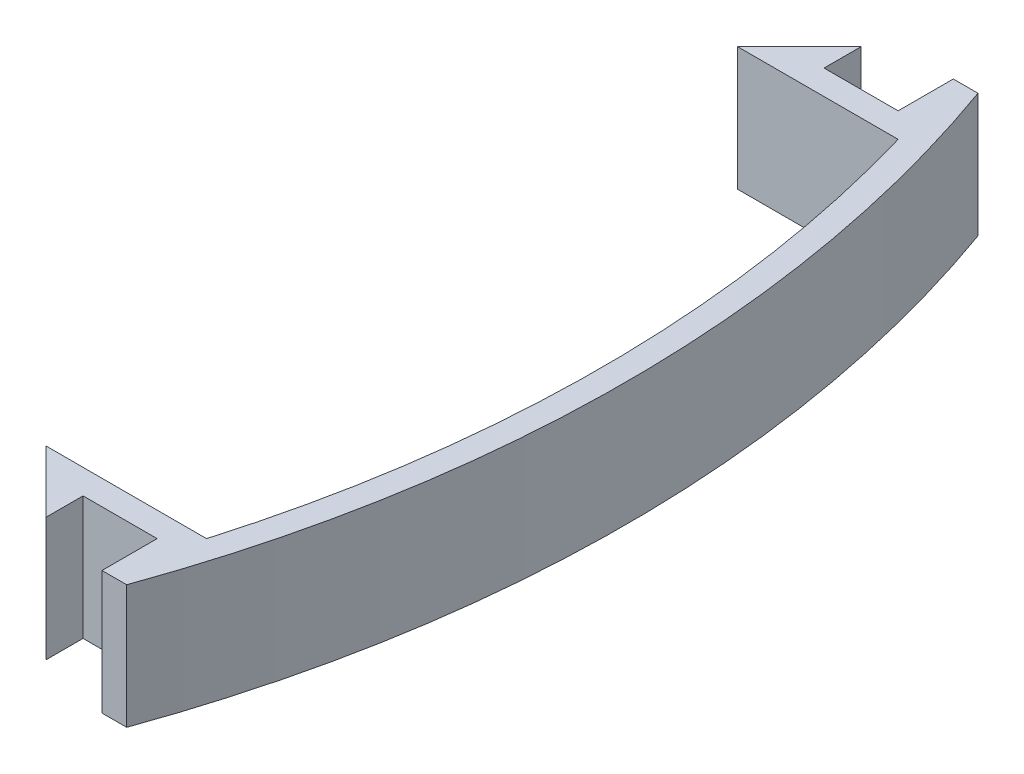
ISO-10303-21;
HEADER;
FILE_DESCRIPTION(('STEP AP214'),'2;1');
FILE_NAME('part.step','',(''),(''),'','','');
FILE_SCHEMA(('AUTOMOTIVE_DESIGN { 1 0 10303 214 1 1 1 1 }'));
ENDSEC;
DATA;
#1=APPLICATION_CONTEXT('core data for automotive mechanical design processes');
#2=APPLICATION_PROTOCOL_DEFINITION('international standard','automotive_design',2000,#1);
#3=PRODUCT_CONTEXT('',#1,'mechanical');
#4=PRODUCT('Part','Part','',(#3));
#5=PRODUCT_RELATED_PRODUCT_CATEGORY('part','',(#4));
#6=PRODUCT_DEFINITION_FORMATION('','',#4);
#7=PRODUCT_DEFINITION_CONTEXT('part definition',#1,'design');
#8=PRODUCT_DEFINITION('design','',#6,#7);
#9=PRODUCT_DEFINITION_SHAPE('','',#8);
#10=(LENGTH_UNIT() NAMED_UNIT(*) SI_UNIT(.MILLI.,.METRE.));
#11=(NAMED_UNIT(*) PLANE_ANGLE_UNIT() SI_UNIT($,.RADIAN.));
#12=(NAMED_UNIT(*) SI_UNIT($,.STERADIAN.) SOLID_ANGLE_UNIT());
#13=UNCERTAINTY_MEASURE_WITH_UNIT(LENGTH_MEASURE(1.E-05),#10,'distance_accuracy_value','');
#14=(GEOMETRIC_REPRESENTATION_CONTEXT(3) GLOBAL_UNCERTAINTY_ASSIGNED_CONTEXT((#13)) GLOBAL_UNIT_ASSIGNED_CONTEXT((#10,
#11,#12)) REPRESENTATION_CONTEXT('',''));
#15=CARTESIAN_POINT('',(0.,0.,0.));
#16=DIRECTION('',(0.,0.,1.));
#17=DIRECTION('',(1.,0.,0.));
#18=AXIS2_PLACEMENT_3D('',#15,#16,#17);
#19=CARTESIAN_POINT('',(-96.,10.,0.));
#20=DIRECTION('',(0.,-1.,0.));
#21=DIRECTION('',(0.,0.,-1.));
#22=AXIS2_PLACEMENT_3D('',#19,#20,#21);
#23=CYLINDRICAL_SURFACE('',#22,100.);
#24=CARTESIAN_POINT('',(-96.,0.,0.));
#25=DIRECTION('',(0.,-1.,0.));
#26=DIRECTION('',(0.,0.,-1.));
#27=AXIS2_PLACEMENT_3D('',#24,#25,#26);
#28=CIRCLE('',#27,100.);
#29=CARTESIAN_POINT('',(0.,0.,-28.));
#30=VERTEX_POINT('',#29);
#31=CARTESIAN_POINT('',(0.,0.,28.));
#32=VERTEX_POINT('',#31);
#33=EDGE_CURVE('E167',#30,#32,#28,.T.);
#34=ORIENTED_EDGE('',*,*,#33,.T.);
#35=DIRECTION('',(0.,-1.,0.));
#36=VECTOR('',#35,1.);
#37=CARTESIAN_POINT('',(0.,10.,28.));
#38=LINE('',#37,#36);
#39=CARTESIAN_POINT('',(0.,10.,28.));
#40=VERTEX_POINT('',#39);
#41=EDGE_CURVE('E11',#40,#32,#38,.T.);
#42=ORIENTED_EDGE('',*,*,#41,.F.);
#43=CARTESIAN_POINT('',(-96.,10.,0.));
#44=DIRECTION('',(0.,-1.,0.));
#45=DIRECTION('',(0.,0.,-1.));
#46=AXIS2_PLACEMENT_3D('',#43,#44,#45);
#47=CIRCLE('',#46,100.);
#48=CARTESIAN_POINT('',(0.,10.,-28.));
#49=VERTEX_POINT('',#48);
#50=EDGE_CURVE('E193',#49,#40,#47,.T.);
#51=ORIENTED_EDGE('',*,*,#50,.F.);
#52=DIRECTION('',(0.,-1.,0.));
#53=VECTOR('',#52,1.);
#54=CARTESIAN_POINT('',(0.,10.,-28.));
#55=LINE('',#54,#53);
#56=EDGE_CURVE('E163',#49,#30,#55,.T.);
#57=ORIENTED_EDGE('',*,*,#56,.T.);
#58=EDGE_LOOP('',(#34,#42,#51,#57));
#59=FACE_BOUND('',#58,.T.);
#60=ADVANCED_FACE('F35',(#59),#23,.F.);
#61=CARTESIAN_POINT('',(0.,10.,28.));
#62=DIRECTION('',(0.,0.,1.));
#63=DIRECTION('',(1.,0.,0.));
#64=AXIS2_PLACEMENT_3D('',#61,#62,#63);
#65=PLANE('',#64);
#66=DIRECTION('',(-1.,0.,0.));
#67=VECTOR('',#66,1.);
#68=CARTESIAN_POINT('',(0.,0.,28.));
#69=LINE('',#68,#67);
#70=CARTESIAN_POINT('',(-13.,0.,28.));
#71=VERTEX_POINT('',#70);
#72=EDGE_CURVE('E170',#32,#71,#69,.T.);
#73=ORIENTED_EDGE('',*,*,#72,.T.);
#74=DIRECTION('',(0.,-1.,0.));
#75=VECTOR('',#74,1.);
#76=CARTESIAN_POINT('',(-13.,10.,28.));
#77=LINE('',#76,#75);
#78=CARTESIAN_POINT('',(-13.,10.,28.));
#79=VERTEX_POINT('',#78);
#80=EDGE_CURVE('E43',#79,#71,#77,.T.);
#81=ORIENTED_EDGE('',*,*,#80,.F.);
#82=DIRECTION('',(-1.,0.,0.));
#83=VECTOR('',#82,1.);
#84=CARTESIAN_POINT('',(0.,10.,28.));
#85=LINE('',#84,#83);
#86=EDGE_CURVE('E112',#40,#79,#85,.T.);
#87=ORIENTED_EDGE('',*,*,#86,.F.);
#88=ORIENTED_EDGE('',*,*,#41,.T.);
#89=EDGE_LOOP('',(#73,#81,#87,#88));
#90=FACE_BOUND('',#89,.T.);
#91=ADVANCED_FACE('F281',(#90),#65,.F.);
#92=CARTESIAN_POINT('',(-13.,10.,28.));
#93=DIRECTION('',(0.707106781186548,0.,-0.707106781186547));
#94=DIRECTION('',(-0.707106781186547,0.,-0.707106781186548));
#95=AXIS2_PLACEMENT_3D('',#92,#93,#94);
#96=PLANE('',#95);
#97=DIRECTION('',(0.707106781186547,0.,0.707106781186548));
#98=VECTOR('',#97,1.);
#99=CARTESIAN_POINT('',(-13.,0.,28.));
#100=LINE('',#99,#98);
#101=CARTESIAN_POINT('',(-7.99999999999999,0.,33.));
#102=VERTEX_POINT('',#101);
#103=EDGE_CURVE('E172',#71,#102,#100,.T.);
#104=ORIENTED_EDGE('',*,*,#103,.T.);
#105=DIRECTION('',(0.,-1.,0.));
#106=VECTOR('',#105,1.);
#107=CARTESIAN_POINT('',(-7.99999999999999,10.,33.));
#108=LINE('',#107,#106);
#109=CARTESIAN_POINT('',(-7.99999999999999,10.,33.));
#110=VERTEX_POINT('',#109);
#111=EDGE_CURVE('E218',#110,#102,#108,.T.);
#112=ORIENTED_EDGE('',*,*,#111,.F.);
#113=DIRECTION('',(0.707106781186547,0.,0.707106781186548));
#114=VECTOR('',#113,1.);
#115=CARTESIAN_POINT('',(-13.,10.,28.));
#116=LINE('',#115,#114);
#117=EDGE_CURVE('E226',#79,#110,#116,.T.);
#118=ORIENTED_EDGE('',*,*,#117,.F.);
#119=ORIENTED_EDGE('',*,*,#80,.T.);
#120=EDGE_LOOP('',(#104,#112,#118,#119));
#121=FACE_BOUND('',#120,.T.);
#122=ADVANCED_FACE('F224',(#121),#96,.F.);
#123=CARTESIAN_POINT('',(-7.99999999999999,10.,33.));
#124=DIRECTION('',(-1.,0.,0.));
#125=DIRECTION('',(0.,0.,1.));
#126=AXIS2_PLACEMENT_3D('',#123,#124,#125);
#127=PLANE('',#126);
#128=DIRECTION('',(0.,0.,-1.));
#129=VECTOR('',#128,1.);
#130=CARTESIAN_POINT('',(-7.99999999999999,0.,33.));
#131=LINE('',#130,#129);
#132=CARTESIAN_POINT('',(-7.99999999999999,0.,30.));
#133=VERTEX_POINT('',#132);
#134=EDGE_CURVE('E174',#102,#133,#131,.T.);
#135=ORIENTED_EDGE('',*,*,#134,.T.);
#136=DIRECTION('',(0.,-1.,0.));
#137=VECTOR('',#136,1.);
#138=CARTESIAN_POINT('',(-7.99999999999999,10.,30.));
#139=LINE('',#138,#137);
#140=CARTESIAN_POINT('',(-7.99999999999999,10.,30.));
#141=VERTEX_POINT('',#140);
#142=EDGE_CURVE('E215',#141,#133,#139,.T.);
#143=ORIENTED_EDGE('',*,*,#142,.F.);
#144=DIRECTION('',(0.,0.,-1.));
#145=VECTOR('',#144,1.);
#146=CARTESIAN_POINT('',(-7.99999999999999,10.,33.));
#147=LINE('',#146,#145);
#148=EDGE_CURVE('E244',#110,#141,#147,.T.);
#149=ORIENTED_EDGE('',*,*,#148,.F.);
#150=ORIENTED_EDGE('',*,*,#111,.T.);
#151=EDGE_LOOP('',(#135,#143,#149,#150));
#152=FACE_BOUND('',#151,.T.);
#153=ADVANCED_FACE('F235',(#152),#127,.F.);
#154=CARTESIAN_POINT('',(-7.99999999999999,10.,30.));
#155=DIRECTION('',(0.,0.,-1.));
#156=DIRECTION('',(-1.,0.,0.));
#157=AXIS2_PLACEMENT_3D('',#154,#155,#156);
#158=PLANE('',#157);
#159=DIRECTION('',(1.,0.,0.));
#160=VECTOR('',#159,1.);
#161=CARTESIAN_POINT('',(-7.99999999999999,0.,30.));
#162=LINE('',#161,#160);
#163=CARTESIAN_POINT('',(-1.99999999999999,0.,30.));
#164=VERTEX_POINT('',#163);
#165=EDGE_CURVE('E176',#133,#164,#162,.T.);
#166=ORIENTED_EDGE('',*,*,#165,.T.);
#167=DIRECTION('',(0.,-1.,0.));
#168=VECTOR('',#167,1.);
#169=CARTESIAN_POINT('',(-1.99999999999999,10.,30.));
#170=LINE('',#169,#168);
#171=CARTESIAN_POINT('',(-1.99999999999999,10.,30.));
#172=VERTEX_POINT('',#171);
#173=EDGE_CURVE('E212',#172,#164,#170,.T.);
#174=ORIENTED_EDGE('',*,*,#173,.F.);
#175=DIRECTION('',(1.,0.,0.));
#176=VECTOR('',#175,1.);
#177=CARTESIAN_POINT('',(-7.99999999999999,10.,30.));
#178=LINE('',#177,#176);
#179=EDGE_CURVE('E241',#141,#172,#178,.T.);
#180=ORIENTED_EDGE('',*,*,#179,.F.);
#181=ORIENTED_EDGE('',*,*,#142,.T.);
#182=EDGE_LOOP('',(#166,#174,#180,#181));
#183=FACE_BOUND('',#182,.T.);
#184=ADVANCED_FACE('F239',(#183),#158,.F.);
#185=CARTESIAN_POINT('',(-1.99999999999999,10.,30.));
#186=DIRECTION('',(1.,0.,0.));
#187=DIRECTION('',(0.,0.,-1.));
#188=AXIS2_PLACEMENT_3D('',#185,#186,#187);
#189=PLANE('',#188);
#190=DIRECTION('',(0.,0.,1.));
#191=VECTOR('',#190,1.);
#192=CARTESIAN_POINT('',(-1.99999999999999,0.,30.));
#193=LINE('',#192,#191);
#194=CARTESIAN_POINT('',(-1.99999999999999,0.,34.4673758792282));
#195=VERTEX_POINT('',#194);
#196=EDGE_CURVE('E178',#164,#195,#193,.T.);
#197=ORIENTED_EDGE('',*,*,#196,.T.);
#198=DIRECTION('',(0.,-1.,0.));
#199=VECTOR('',#198,1.);
#200=CARTESIAN_POINT('',(-1.99999999999999,10.,34.4673758792282));
#201=LINE('',#200,#199);
#202=CARTESIAN_POINT('',(-1.99999999999999,10.,34.4673758792282));
#203=VERTEX_POINT('',#202);
#204=EDGE_CURVE('E209',#203,#195,#201,.T.);
#205=ORIENTED_EDGE('',*,*,#204,.F.);
#206=DIRECTION('',(0.,0.,1.));
#207=VECTOR('',#206,1.);
#208=CARTESIAN_POINT('',(-1.99999999999999,10.,30.));
#209=LINE('',#208,#207);
#210=EDGE_CURVE('E243',#172,#203,#209,.T.);
#211=ORIENTED_EDGE('',*,*,#210,.F.);
#212=ORIENTED_EDGE('',*,*,#173,.T.);
#213=EDGE_LOOP('',(#197,#205,#211,#212));
#214=FACE_BOUND('',#213,.T.);
#215=ADVANCED_FACE('F294',(#214),#189,.F.);
#216=CARTESIAN_POINT('',(0.,10.,34.4673758792282));
#217=DIRECTION('',(0.,0.,-1.));
#218=DIRECTION('',(-1.,0.,0.));
#219=AXIS2_PLACEMENT_3D('',#216,#217,#218);
#220=PLANE('',#219);
#221=DIRECTION('',(1.,0.,0.));
#222=VECTOR('',#221,1.);
#223=CARTESIAN_POINT('',(0.,0.,34.4673758792282));
#224=LINE('',#223,#222);
#225=CARTESIAN_POINT('',(0.,0.,34.4673758792282));
#226=VERTEX_POINT('',#225);
#227=EDGE_CURVE('E180',#195,#226,#224,.T.);
#228=ORIENTED_EDGE('',*,*,#227,.T.);
#229=DIRECTION('',(0.,-1.,0.));
#230=VECTOR('',#229,1.);
#231=CARTESIAN_POINT('',(0.,10.,34.4673758792282));
#232=LINE('',#231,#230);
#233=CARTESIAN_POINT('',(0.,10.,34.4673758792282));
#234=VERTEX_POINT('',#233);
#235=EDGE_CURVE('E206',#234,#226,#232,.T.);
#236=ORIENTED_EDGE('',*,*,#235,.F.);
#237=DIRECTION('',(1.,0.,0.));
#238=VECTOR('',#237,1.);
#239=CARTESIAN_POINT('',(0.,10.,34.4673758792282));
#240=LINE('',#239,#238);
#241=EDGE_CURVE('E246',#203,#234,#240,.T.);
#242=ORIENTED_EDGE('',*,*,#241,.F.);
#243=ORIENTED_EDGE('',*,*,#204,.T.);
#244=EDGE_LOOP('',(#228,#236,#242,#243));
#245=FACE_BOUND('',#244,.T.);
#246=ADVANCED_FACE('F297',(#245),#220,.F.);
#247=CARTESIAN_POINT('',(-96.,10.,0.));
#248=DIRECTION('',(0.,-1.,0.));
#249=DIRECTION('',(0.,0.,-1.));
#250=AXIS2_PLACEMENT_3D('',#247,#248,#249);
#251=CYLINDRICAL_SURFACE('',#250,102.);
#252=CARTESIAN_POINT('',(-96.,0.,0.));
#253=DIRECTION('',(0.,1.,0.));
#254=DIRECTION('',(0.,0.,1.));
#255=AXIS2_PLACEMENT_3D('',#252,#253,#254);
#256=CIRCLE('',#255,102.);
#257=CARTESIAN_POINT('',(0.,0.,-34.4673758792282));
#258=VERTEX_POINT('',#257);
#259=EDGE_CURVE('E182',#226,#258,#256,.T.);
#260=ORIENTED_EDGE('',*,*,#259,.T.);
#261=DIRECTION('',(0.,-1.,0.));
#262=VECTOR('',#261,1.);
#263=CARTESIAN_POINT('',(0.,10.,-34.4673758792282));
#264=LINE('',#263,#262);
#265=CARTESIAN_POINT('',(0.,10.,-34.4673758792282));
#266=VERTEX_POINT('',#265);
#267=EDGE_CURVE('E203',#266,#258,#264,.T.);
#268=ORIENTED_EDGE('',*,*,#267,.F.);
#269=CARTESIAN_POINT('',(-96.,10.,0.));
#270=DIRECTION('',(0.,1.,0.));
#271=DIRECTION('',(0.,0.,1.));
#272=AXIS2_PLACEMENT_3D('',#269,#270,#271);
#273=CIRCLE('',#272,102.);
#274=EDGE_CURVE('E252',#234,#266,#273,.T.);
#275=ORIENTED_EDGE('',*,*,#274,.F.);
#276=ORIENTED_EDGE('',*,*,#235,.T.);
#277=EDGE_LOOP('',(#260,#268,#275,#276));
#278=FACE_BOUND('',#277,.T.);
#279=ADVANCED_FACE('F301',(#278),#251,.T.);
#280=CARTESIAN_POINT('',(0.,10.,-34.4673758792282));
#281=DIRECTION('',(0.,0.,1.));
#282=DIRECTION('',(1.,0.,0.));
#283=AXIS2_PLACEMENT_3D('',#280,#281,#282);
#284=PLANE('',#283);
#285=DIRECTION('',(-1.,0.,0.));
#286=VECTOR('',#285,1.);
#287=CARTESIAN_POINT('',(0.,0.,-34.4673758792282));
#288=LINE('',#287,#286);
#289=CARTESIAN_POINT('',(-1.99999999999999,0.,-34.4673758792282));
#290=VERTEX_POINT('',#289);
#291=EDGE_CURVE('E184',#258,#290,#288,.T.);
#292=ORIENTED_EDGE('',*,*,#291,.T.);
#293=DIRECTION('',(0.,-1.,0.));
#294=VECTOR('',#293,1.);
#295=CARTESIAN_POINT('',(-1.99999999999999,10.,-34.4673758792282));
#296=LINE('',#295,#294);
#297=CARTESIAN_POINT('',(-1.99999999999999,10.,-34.4673758792282));
#298=VERTEX_POINT('',#297);
#299=EDGE_CURVE('E200',#298,#290,#296,.T.);
#300=ORIENTED_EDGE('',*,*,#299,.F.);
#301=DIRECTION('',(-1.,0.,0.));
#302=VECTOR('',#301,1.);
#303=CARTESIAN_POINT('',(0.,10.,-34.4673758792282));
#304=LINE('',#303,#302);
#305=EDGE_CURVE('E254',#266,#298,#304,.T.);
#306=ORIENTED_EDGE('',*,*,#305,.F.);
#307=ORIENTED_EDGE('',*,*,#267,.T.);
#308=EDGE_LOOP('',(#292,#300,#306,#307));
#309=FACE_BOUND('',#308,.T.);
#310=ADVANCED_FACE('F305',(#309),#284,.F.);
#311=CARTESIAN_POINT('',(-1.99999999999999,10.,-30.));
#312=DIRECTION('',(1.,0.,0.));
#313=DIRECTION('',(0.,0.,-1.));
#314=AXIS2_PLACEMENT_3D('',#311,#312,#313);
#315=PLANE('',#314);
#316=DIRECTION('',(0.,0.,1.));
#317=VECTOR('',#316,1.);
#318=CARTESIAN_POINT('',(-1.99999999999999,0.,-30.));
#319=LINE('',#318,#317);
#320=CARTESIAN_POINT('',(-1.99999999999999,0.,-30.));
#321=VERTEX_POINT('',#320);
#322=EDGE_CURVE('E186',#290,#321,#319,.T.);
#323=ORIENTED_EDGE('',*,*,#322,.T.);
#324=DIRECTION('',(0.,-1.,0.));
#325=VECTOR('',#324,1.);
#326=CARTESIAN_POINT('',(-1.99999999999999,10.,-30.));
#327=LINE('',#326,#325);
#328=CARTESIAN_POINT('',(-1.99999999999999,10.,-30.));
#329=VERTEX_POINT('',#328);
#330=EDGE_CURVE('E197',#329,#321,#327,.T.);
#331=ORIENTED_EDGE('',*,*,#330,.F.);
#332=DIRECTION('',(0.,0.,1.));
#333=VECTOR('',#332,1.);
#334=CARTESIAN_POINT('',(-1.99999999999999,10.,-30.));
#335=LINE('',#334,#333);
#336=EDGE_CURVE('E256',#298,#329,#335,.T.);
#337=ORIENTED_EDGE('',*,*,#336,.F.);
#338=ORIENTED_EDGE('',*,*,#299,.T.);
#339=EDGE_LOOP('',(#323,#331,#337,#338));
#340=FACE_BOUND('',#339,.T.);
#341=ADVANCED_FACE('F262',(#340),#315,.F.);
#342=CARTESIAN_POINT('',(-7.99999999999999,10.,-30.));
#343=DIRECTION('',(0.,0.,1.));
#344=DIRECTION('',(1.,0.,0.));
#345=AXIS2_PLACEMENT_3D('',#342,#343,#344);
#346=PLANE('',#345);
#347=DIRECTION('',(-1.,0.,0.));
#348=VECTOR('',#347,1.);
#349=CARTESIAN_POINT('',(-7.99999999999999,0.,-30.));
#350=LINE('',#349,#348);
#351=CARTESIAN_POINT('',(-7.99999999999999,0.,-30.));
#352=VERTEX_POINT('',#351);
#353=EDGE_CURVE('E188',#321,#352,#350,.T.);
#354=ORIENTED_EDGE('',*,*,#353,.T.);
#355=DIRECTION('',(0.,-1.,0.));
#356=VECTOR('',#355,1.);
#357=CARTESIAN_POINT('',(-7.99999999999999,10.,-30.));
#358=LINE('',#357,#356);
#359=CARTESIAN_POINT('',(-7.99999999999999,10.,-30.));
#360=VERTEX_POINT('',#359);
#361=EDGE_CURVE('E158',#360,#352,#358,.T.);
#362=ORIENTED_EDGE('',*,*,#361,.F.);
#363=DIRECTION('',(-1.,0.,0.));
#364=VECTOR('',#363,1.);
#365=CARTESIAN_POINT('',(-7.99999999999999,10.,-30.));
#366=LINE('',#365,#364);
#367=EDGE_CURVE('E149',#329,#360,#366,.T.);
#368=ORIENTED_EDGE('',*,*,#367,.F.);
#369=ORIENTED_EDGE('',*,*,#330,.T.);
#370=EDGE_LOOP('',(#354,#362,#368,#369));
#371=FACE_BOUND('',#370,.T.);
#372=ADVANCED_FACE('F266',(#371),#346,.F.);
#373=CARTESIAN_POINT('',(-8.,10.,-33.));
#374=DIRECTION('',(-1.,0.,0.));
#375=DIRECTION('',(0.,0.,1.));
#376=AXIS2_PLACEMENT_3D('',#373,#374,#375);
#377=PLANE('',#376);
#378=DIRECTION('',(0.,0.,-1.));
#379=VECTOR('',#378,1.);
#380=CARTESIAN_POINT('',(-8.,0.,-33.));
#381=LINE('',#380,#379);
#382=CARTESIAN_POINT('',(-8.,0.,-33.));
#383=VERTEX_POINT('',#382);
#384=EDGE_CURVE('E157',#352,#383,#381,.T.);
#385=ORIENTED_EDGE('',*,*,#384,.T.);
#386=DIRECTION('',(0.,-1.,0.));
#387=VECTOR('',#386,1.);
#388=CARTESIAN_POINT('',(-8.,10.,-33.));
#389=LINE('',#388,#387);
#390=CARTESIAN_POINT('',(-8.,10.,-33.));
#391=VERTEX_POINT('',#390);
#392=EDGE_CURVE('E154',#391,#383,#389,.T.);
#393=ORIENTED_EDGE('',*,*,#392,.F.);
#394=DIRECTION('',(0.,0.,-1.));
#395=VECTOR('',#394,1.);
#396=CARTESIAN_POINT('',(-8.,10.,-33.));
#397=LINE('',#396,#395);
#398=EDGE_CURVE('E143',#360,#391,#397,.T.);
#399=ORIENTED_EDGE('',*,*,#398,.F.);
#400=ORIENTED_EDGE('',*,*,#361,.T.);
#401=EDGE_LOOP('',(#385,#393,#399,#400));
#402=FACE_BOUND('',#401,.T.);
#403=ADVANCED_FACE('F155',(#402),#377,.F.);
#404=CARTESIAN_POINT('',(-13.,10.,-28.));
#405=DIRECTION('',(0.707106781186548,0.,0.707106781186547));
#406=DIRECTION('',(0.707106781186547,0.,-0.707106781186548));
#407=AXIS2_PLACEMENT_3D('',#404,#405,#406);
#408=PLANE('',#407);
#409=DIRECTION('',(-0.707106781186547,0.,0.707106781186548));
#410=VECTOR('',#409,1.);
#411=CARTESIAN_POINT('',(-13.,0.,-28.));
#412=LINE('',#411,#410);
#413=CARTESIAN_POINT('',(-13.,0.,-28.));
#414=VERTEX_POINT('',#413);
#415=EDGE_CURVE('E98',#383,#414,#412,.T.);
#416=ORIENTED_EDGE('',*,*,#415,.T.);
#417=DIRECTION('',(0.,-1.,0.));
#418=VECTOR('',#417,1.);
#419=CARTESIAN_POINT('',(-13.,10.,-28.));
#420=LINE('',#419,#418);
#421=CARTESIAN_POINT('',(-13.,10.,-28.));
#422=VERTEX_POINT('',#421);
#423=EDGE_CURVE('E159',#422,#414,#420,.T.);
#424=ORIENTED_EDGE('',*,*,#423,.F.);
#425=DIRECTION('',(-0.707106781186547,0.,0.707106781186548));
#426=VECTOR('',#425,1.);
#427=CARTESIAN_POINT('',(-13.,10.,-28.));
#428=LINE('',#427,#426);
#429=EDGE_CURVE('E147',#391,#422,#428,.T.);
#430=ORIENTED_EDGE('',*,*,#429,.F.);
#431=ORIENTED_EDGE('',*,*,#392,.T.);
#432=EDGE_LOOP('',(#416,#424,#430,#431));
#433=FACE_BOUND('',#432,.T.);
#434=ADVANCED_FACE('F161',(#433),#408,.F.);
#435=CARTESIAN_POINT('',(0.,10.,-28.));
#436=DIRECTION('',(0.,0.,-1.));
#437=DIRECTION('',(-1.,0.,0.));
#438=AXIS2_PLACEMENT_3D('',#435,#436,#437);
#439=PLANE('',#438);
#440=DIRECTION('',(1.,0.,0.));
#441=VECTOR('',#440,1.);
#442=CARTESIAN_POINT('',(0.,0.,-28.));
#443=LINE('',#442,#441);
#444=EDGE_CURVE('E104',#414,#30,#443,.T.);
#445=ORIENTED_EDGE('',*,*,#444,.T.);
#446=ORIENTED_EDGE('',*,*,#56,.F.);
#447=DIRECTION('',(1.,0.,0.));
#448=VECTOR('',#447,1.);
#449=CARTESIAN_POINT('',(0.,10.,-28.));
#450=LINE('',#449,#448);
#451=EDGE_CURVE('E51',#422,#49,#450,.T.);
#452=ORIENTED_EDGE('',*,*,#451,.F.);
#453=ORIENTED_EDGE('',*,*,#423,.T.);
#454=EDGE_LOOP('',(#445,#446,#452,#453));
#455=FACE_BOUND('',#454,.T.);
#456=ADVANCED_FACE('F270',(#455),#439,.F.);
#457=CARTESIAN_POINT('',(-96.,10.,0.));
#458=DIRECTION('',(0.,-1.,0.));
#459=DIRECTION('',(0.,0.,-1.));
#460=AXIS2_PLACEMENT_3D('',#457,#458,#459);
#461=PLANE('',#460);
#462=ORIENTED_EDGE('',*,*,#50,.T.);
#463=ORIENTED_EDGE('',*,*,#86,.T.);
#464=ORIENTED_EDGE('',*,*,#117,.T.);
#465=ORIENTED_EDGE('',*,*,#148,.T.);
#466=ORIENTED_EDGE('',*,*,#179,.T.);
#467=ORIENTED_EDGE('',*,*,#210,.T.);
#468=ORIENTED_EDGE('',*,*,#241,.T.);
#469=ORIENTED_EDGE('',*,*,#274,.T.);
#470=ORIENTED_EDGE('',*,*,#305,.T.);
#471=ORIENTED_EDGE('',*,*,#336,.T.);
#472=ORIENTED_EDGE('',*,*,#367,.T.);
#473=ORIENTED_EDGE('',*,*,#398,.T.);
#474=ORIENTED_EDGE('',*,*,#429,.T.);
#475=ORIENTED_EDGE('',*,*,#451,.T.);
#476=EDGE_LOOP('',(#462,#463,#464,#465,#466,#467,#468,#469,#470,#471,#472,#473,#474,#475));
#477=FACE_BOUND('',#476,.T.);
#478=ADVANCED_FACE('F145',(#477),#461,.F.);
#479=CARTESIAN_POINT('',(-96.,0.,0.));
#480=DIRECTION('',(0.,-1.,0.));
#481=DIRECTION('',(0.,0.,-1.));
#482=AXIS2_PLACEMENT_3D('',#479,#480,#481);
#483=PLANE('',#482);
#484=ORIENTED_EDGE('',*,*,#33,.F.);
#485=ORIENTED_EDGE('',*,*,#444,.F.);
#486=ORIENTED_EDGE('',*,*,#415,.F.);
#487=ORIENTED_EDGE('',*,*,#384,.F.);
#488=ORIENTED_EDGE('',*,*,#353,.F.);
#489=ORIENTED_EDGE('',*,*,#322,.F.);
#490=ORIENTED_EDGE('',*,*,#291,.F.);
#491=ORIENTED_EDGE('',*,*,#259,.F.);
#492=ORIENTED_EDGE('',*,*,#227,.F.);
#493=ORIENTED_EDGE('',*,*,#196,.F.);
#494=ORIENTED_EDGE('',*,*,#165,.F.);
#495=ORIENTED_EDGE('',*,*,#134,.F.);
#496=ORIENTED_EDGE('',*,*,#103,.F.);
#497=ORIENTED_EDGE('',*,*,#72,.F.);
#498=EDGE_LOOP('',(#484,#485,#486,#487,#488,#489,#490,#491,#492,#493,#494,#495,#496,#497));
#499=FACE_BOUND('',#498,.T.);
#500=ADVANCED_FACE('F230',(#499),#483,.T.);
#501=CLOSED_SHELL('',(#60,#91,#122,#153,#184,#215,#246,#279,#310,#341,#372,#403,#434,#456,#478,#500));
#502=MANIFOLD_SOLID_BREP('B2',#501);
#503=ADVANCED_BREP_SHAPE_REPRESENTATION('',(#18,#502),#14);
#504=SHAPE_DEFINITION_REPRESENTATION(#9,#503);
ENDSEC;
END-ISO-10303-21;
